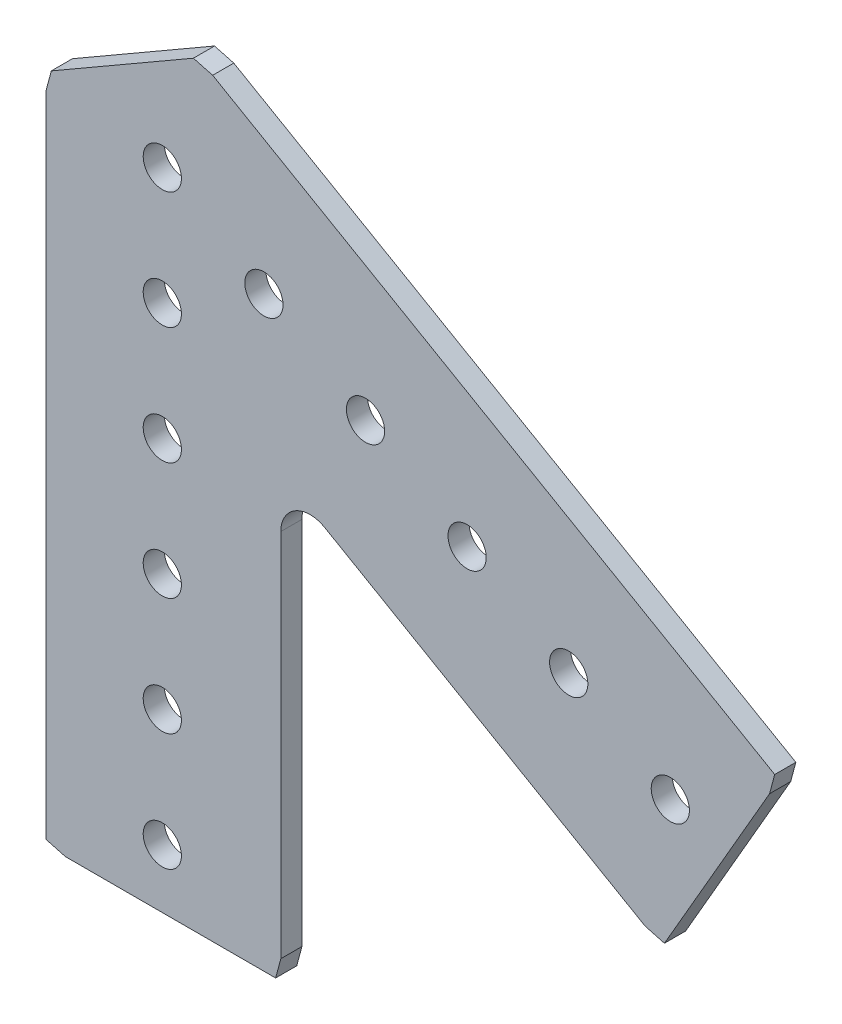
ISO-10303-21;
HEADER;
FILE_DESCRIPTION(('STEP AP214'),'2;1');
FILE_NAME('part.step','',(''),(''),'','','');
FILE_SCHEMA(('AUTOMOTIVE_DESIGN { 1 0 10303 214 1 1 1 1 }'));
ENDSEC;
DATA;
#1=APPLICATION_CONTEXT('core data for automotive mechanical design processes');
#2=APPLICATION_PROTOCOL_DEFINITION('international standard','automotive_design',2000,#1);
#3=PRODUCT_CONTEXT('',#1,'mechanical');
#4=PRODUCT('Part','Part','',(#3));
#5=PRODUCT_RELATED_PRODUCT_CATEGORY('part','',(#4));
#6=PRODUCT_DEFINITION_FORMATION('','',#4);
#7=PRODUCT_DEFINITION_CONTEXT('part definition',#1,'design');
#8=PRODUCT_DEFINITION('design','',#6,#7);
#9=PRODUCT_DEFINITION_SHAPE('','',#8);
#10=(LENGTH_UNIT() NAMED_UNIT(*) SI_UNIT(.MILLI.,.METRE.));
#11=(NAMED_UNIT(*) PLANE_ANGLE_UNIT() SI_UNIT($,.RADIAN.));
#12=(NAMED_UNIT(*) SI_UNIT($,.STERADIAN.) SOLID_ANGLE_UNIT());
#13=UNCERTAINTY_MEASURE_WITH_UNIT(LENGTH_MEASURE(1.E-05),#10,'distance_accuracy_value','');
#14=(GEOMETRIC_REPRESENTATION_CONTEXT(3) GLOBAL_UNCERTAINTY_ASSIGNED_CONTEXT((#13)) GLOBAL_UNIT_ASSIGNED_CONTEXT((#10,
#11,#12)) REPRESENTATION_CONTEXT('',''));
#15=CARTESIAN_POINT('',(0.,0.,0.));
#16=DIRECTION('',(0.,0.,1.));
#17=DIRECTION('',(1.,0.,0.));
#18=AXIS2_PLACEMENT_3D('',#15,#16,#17);
#19=CARTESIAN_POINT('',(66.7783744543429,-24.0364625982186,2.286));
#20=DIRECTION('',(0.,0.,1.));
#21=DIRECTION('',(1.,0.,0.));
#22=AXIS2_PLACEMENT_3D('',#19,#20,#21);
#23=PLANE('',#22);
#24=DIRECTION('',(0.866025403784439,-0.5,0.));
#25=VECTOR('',#24,1.);
#26=CARTESIAN_POINT('',(-6.41350000000018,-11.1085078543433,2.286));
#27=LINE('',#26,#25);
#28=CARTESIAN_POINT('',(52.2723357545729,-44.9907909248642,2.286));
#29=VERTEX_POINT('',#28);
#30=CARTESIAN_POINT('',(17.5895,-24.966646365702,2.286));
#31=VERTEX_POINT('',#30);
#32=EDGE_CURVE('E120',#29,#31,#27,.F.);
#33=ORIENTED_EDGE('',*,*,#32,.F.);
#34=DIRECTION('',(0.965925826289069,-0.258819045102517,0.));
#35=VECTOR('',#34,1.);
#36=CARTESIAN_POINT('',(-7.74611519323443,-28.9088954624325,2.286));
#37=LINE('',#36,#35);
#38=CARTESIAN_POINT('',(54.357769613531,-45.5495812432405,2.286));
#39=VERTEX_POINT('',#38);
#40=EDGE_CURVE('E138',#39,#29,#37,.F.);
#41=ORIENTED_EDGE('',*,*,#40,.F.);
#42=DIRECTION('',(-0.500000000000004,-0.866025403784436,0.));
#43=VECTOR('',#42,1.);
#44=CARTESIAN_POINT('',(66.7783744543429,-24.0364625982186,2.286));
#45=LINE('',#44,#43);
#46=CARTESIAN_POINT('',(65.7356575248637,-25.8425012979888,2.286));
#47=VERTEX_POINT('',#46);
#48=EDGE_CURVE('E258',#39,#47,#45,.F.);
#49=ORIENTED_EDGE('',*,*,#48,.T.);
#50=DIRECTION('',(0.258819045102515,0.96592582628907,0.));
#51=VECTOR('',#50,1.);
#52=CARTESIAN_POINT('',(67.7928287624319,-18.1650337195146,2.286));
#53=LINE('',#52,#51);
#54=CARTESIAN_POINT('',(66.2944478432401,-23.7570674390303,2.286));
#55=VERTEX_POINT('',#54);
#56=EDGE_CURVE('E256',#55,#47,#53,.F.);
#57=ORIENTED_EDGE('',*,*,#56,.F.);
#58=DIRECTION('',(0.866025403784436,-0.500000000000004,0.));
#59=VECTOR('',#58,1.);
#60=CARTESIAN_POINT('',(3.92478394209358,12.2520748035635,2.286));
#61=LINE('',#60,#59);
#62=CARTESIAN_POINT('',(5.45142748267629,11.3706667444515,2.286));
#63=VERTEX_POINT('',#62);
#64=EDGE_CURVE('E236',#55,#63,#61,.F.);
#65=ORIENTED_EDGE('',*,*,#64,.T.);
#66=DIRECTION('',(0.96592582628907,-0.258819045102515,0.));
#67=VECTOR('',#66,1.);
#68=CARTESIAN_POINT('',(3.20784308400778,11.9718333722257,2.286));
#69=LINE('',#68,#67);
#70=CARTESIAN_POINT('',(3.36599362371686,11.9294570628281,2.286));
#71=VERTEX_POINT('',#70);
#72=EDGE_CURVE('E225',#63,#71,#69,.F.);
#73=ORIENTED_EDGE('',*,*,#72,.T.);
#74=DIRECTION('',(0.86602540378444,0.499999999999998,0.));
#75=VECTOR('',#74,1.);
#76=CARTESIAN_POINT('',(-12.573,2.72707480356353,2.286));
#77=LINE('',#76,#75);
#78=CARTESIAN_POINT('',(-12.0142096816237,3.04969254429867,2.286));
#79=VERTEX_POINT('',#78);
#80=EDGE_CURVE('E224',#71,#79,#77,.F.);
#81=ORIENTED_EDGE('',*,*,#80,.T.);
#82=DIRECTION('',(-0.258819045102515,-0.96592582628907,0.));
#83=VECTOR('',#82,1.);
#84=CARTESIAN_POINT('',(-11.971833372226,3.20784308400785,2.286));
#85=LINE('',#84,#83);
#86=CARTESIAN_POINT('',(-12.573,0.964258685340516,2.286));
#87=VERTEX_POINT('',#86);
#88=EDGE_CURVE('E213',#87,#79,#85,.F.);
#89=ORIENTED_EDGE('',*,*,#88,.F.);
#90=DIRECTION('',(0.,1.,0.));
#91=VECTOR('',#90,1.);
#92=CARTESIAN_POINT('',(-12.573,-69.85,2.286));
#93=LINE('',#92,#91);
#94=CARTESIAN_POINT('',(-12.573,-69.2912096816237,2.286));
#95=VERTEX_POINT('',#94);
#96=EDGE_CURVE('E193',#87,#95,#93,.F.);
#97=ORIENTED_EDGE('',*,*,#96,.T.);
#98=DIRECTION('',(-0.965925826289072,0.258819045102508,0.));
#99=VECTOR('',#98,1.);
#100=CARTESIAN_POINT('',(-18.1650337195142,-67.7928287624323,2.286));
#101=LINE('',#100,#99);
#102=CARTESIAN_POINT('',(-10.4875661410418,-69.85,2.286));
#103=VERTEX_POINT('',#102);
#104=EDGE_CURVE('E182',#95,#103,#101,.F.);
#105=ORIENTED_EDGE('',*,*,#104,.T.);
#106=DIRECTION('',(-1.,0.,0.));
#107=VECTOR('',#106,1.);
#108=CARTESIAN_POINT('',(12.827,-69.85,2.286));
#109=LINE('',#108,#107);
#110=CARTESIAN_POINT('',(12.2682096816237,-69.85,2.286));
#111=VERTEX_POINT('',#110);
#112=EDGE_CURVE('E181',#103,#111,#109,.F.);
#113=ORIENTED_EDGE('',*,*,#112,.T.);
#114=DIRECTION('',(0.258819045102515,0.96592582628907,0.));
#115=VECTOR('',#114,1.);
#116=CARTESIAN_POINT('',(28.9088954624317,-7.74611519323413,2.286));
#117=LINE('',#116,#115);
#118=CARTESIAN_POINT('',(12.827,-67.7645661410419,2.286));
#119=VERTEX_POINT('',#118);
#120=EDGE_CURVE('E170',#119,#111,#117,.F.);
#121=ORIENTED_EDGE('',*,*,#120,.F.);
#122=DIRECTION('',(0.,-1.,0.));
#123=VECTOR('',#122,1.);
#124=CARTESIAN_POINT('',(12.827,0.,2.286));
#125=LINE('',#124,#123);
#126=CARTESIAN_POINT('',(12.827,-27.7162770227176,2.286));
#127=VERTEX_POINT('',#126);
#128=EDGE_CURVE('E114',#119,#127,#125,.F.);
#129=ORIENTED_EDGE('',*,*,#128,.T.);
#130=CARTESIAN_POINT('',(16.002,-27.7162770227176,2.286));
#131=DIRECTION('',(0.,0.,1.));
#132=DIRECTION('',(1.,0.,0.));
#133=AXIS2_PLACEMENT_3D('',#130,#131,#132);
#134=CIRCLE('',#133,3.175);
#135=EDGE_CURVE('E127',#127,#31,#134,.F.);
#136=ORIENTED_EDGE('',*,*,#135,.T.);
#137=EDGE_LOOP('',(#33,#41,#49,#57,#65,#73,#81,#89,#97,#105,#113,#121,#129,#136));
#138=FACE_BOUND('',#137,.T.);
#139=CARTESIAN_POINT('',(54.9926131403117,-31.7500000000003,2.286));
#140=DIRECTION('',(0.,0.,-1.));
#141=DIRECTION('',(-1.,0.,0.));
#142=AXIS2_PLACEMENT_3D('',#139,#140,#141);
#143=CIRCLE('',#142,2.0701);
#144=CARTESIAN_POINT('',(52.9225131403117,-31.7500000000003,2.286));
#145=VERTEX_POINT('',#144);
#146=EDGE_CURVE('E253',#145,#145,#143,.T.);
#147=ORIENTED_EDGE('',*,*,#146,.T.);
#148=EDGE_LOOP('',(#147));
#149=FACE_BOUND('',#148,.T.);
#150=CARTESIAN_POINT('',(32.9955678841874,-19.0499999999996,2.286));
#151=DIRECTION('',(0.,0.,-1.));
#152=DIRECTION('',(-1.,0.,0.));
#153=AXIS2_PLACEMENT_3D('',#150,#151,#152);
#154=CIRCLE('',#153,2.0701);
#155=CARTESIAN_POINT('',(30.9254678841874,-19.0499999999996,2.286));
#156=VERTEX_POINT('',#155);
#157=EDGE_CURVE('E340',#156,#156,#154,.T.);
#158=ORIENTED_EDGE('',*,*,#157,.T.);
#159=EDGE_LOOP('',(#158));
#160=FACE_BOUND('',#159,.T.);
#161=CARTESIAN_POINT('',(0.,-50.8,2.286));
#162=DIRECTION('',(0.,0.,-1.));
#163=DIRECTION('',(-1.,0.,0.));
#164=AXIS2_PLACEMENT_3D('',#161,#162,#163);
#165=CIRCLE('',#164,2.0701);
#166=CARTESIAN_POINT('',(-2.07009999999999,-50.8,2.286));
#167=VERTEX_POINT('',#166);
#168=EDGE_CURVE('E343',#167,#167,#165,.T.);
#169=ORIENTED_EDGE('',*,*,#168,.T.);
#170=EDGE_LOOP('',(#169));
#171=FACE_BOUND('',#170,.T.);
#172=CARTESIAN_POINT('',(2.66050878019847E-13,-25.4,2.286));
#173=DIRECTION('',(0.,0.,-1.));
#174=DIRECTION('',(-1.,0.,0.));
#175=AXIS2_PLACEMENT_3D('',#172,#173,#174);
#176=CIRCLE('',#175,2.0701);
#177=CARTESIAN_POINT('',(-2.07009999999973,-25.4,2.286));
#178=VERTEX_POINT('',#177);
#179=EDGE_CURVE('E346',#178,#178,#176,.T.);
#180=ORIENTED_EDGE('',*,*,#179,.T.);
#181=EDGE_LOOP('',(#180));
#182=FACE_BOUND('',#181,.T.);
#183=CARTESIAN_POINT('',(10.9985226280625,-6.34999999999986,2.286));
#184=DIRECTION('',(0.,0.,-1.));
#185=DIRECTION('',(-1.,0.,0.));
#186=AXIS2_PLACEMENT_3D('',#183,#184,#185);
#187=CIRCLE('',#186,2.0701);
#188=CARTESIAN_POINT('',(8.92842262806245,-6.34999999999986,2.286));
#189=VERTEX_POINT('',#188);
#190=EDGE_CURVE('E349',#189,#189,#187,.T.);
#191=ORIENTED_EDGE('',*,*,#190,.T.);
#192=EDGE_LOOP('',(#191));
#193=FACE_BOUND('',#192,.T.);
#194=CARTESIAN_POINT('',(0.,0.,2.286));
#195=DIRECTION('',(0.,0.,-1.));
#196=DIRECTION('',(-1.,0.,0.));
#197=AXIS2_PLACEMENT_3D('',#194,#195,#196);
#198=CIRCLE('',#197,2.0701);
#199=CARTESIAN_POINT('',(-2.0701,0.,2.286));
#200=VERTEX_POINT('',#199);
#201=EDGE_CURVE('E352',#200,#200,#198,.T.);
#202=ORIENTED_EDGE('',*,*,#201,.T.);
#203=EDGE_LOOP('',(#202));
#204=FACE_BOUND('',#203,.T.);
#205=CARTESIAN_POINT('',(1.33025439009923E-13,-12.7,2.286));
#206=DIRECTION('',(0.,0.,-1.));
#207=DIRECTION('',(-1.,0.,0.));
#208=AXIS2_PLACEMENT_3D('',#205,#206,#207);
#209=CIRCLE('',#208,2.0701);
#210=CARTESIAN_POINT('',(-2.07009999999987,-12.7,2.286));
#211=VERTEX_POINT('',#210);
#212=EDGE_CURVE('E355',#211,#211,#209,.T.);
#213=ORIENTED_EDGE('',*,*,#212,.T.);
#214=EDGE_LOOP('',(#213));
#215=FACE_BOUND('',#214,.T.);
#216=CARTESIAN_POINT('',(3.9907631702977E-13,-38.1,2.286));
#217=DIRECTION('',(0.,0.,-1.));
#218=DIRECTION('',(-1.,0.,0.));
#219=AXIS2_PLACEMENT_3D('',#216,#217,#218);
#220=CIRCLE('',#219,2.0701);
#221=CARTESIAN_POINT('',(-2.0700999999996,-38.1,2.286));
#222=VERTEX_POINT('',#221);
#223=EDGE_CURVE('E358',#222,#222,#220,.T.);
#224=ORIENTED_EDGE('',*,*,#223,.T.);
#225=EDGE_LOOP('',(#224));
#226=FACE_BOUND('',#225,.T.);
#227=CARTESIAN_POINT('',(21.9970452561249,-12.6999999999997,2.286));
#228=DIRECTION('',(0.,0.,-1.));
#229=DIRECTION('',(-1.,0.,0.));
#230=AXIS2_PLACEMENT_3D('',#227,#228,#229);
#231=CIRCLE('',#230,2.0701);
#232=CARTESIAN_POINT('',(19.9269452561249,-12.6999999999997,2.286));
#233=VERTEX_POINT('',#232);
#234=EDGE_CURVE('E361',#233,#233,#231,.T.);
#235=ORIENTED_EDGE('',*,*,#234,.T.);
#236=EDGE_LOOP('',(#235));
#237=FACE_BOUND('',#236,.T.);
#238=CARTESIAN_POINT('',(43.9940905122498,-25.3999999999994,2.286));
#239=DIRECTION('',(0.,0.,-1.));
#240=DIRECTION('',(-1.,0.,0.));
#241=AXIS2_PLACEMENT_3D('',#238,#239,#240);
#242=CIRCLE('',#241,2.0701);
#243=CARTESIAN_POINT('',(41.9239905122498,-25.3999999999994,2.286));
#244=VERTEX_POINT('',#243);
#245=EDGE_CURVE('E363',#244,#244,#242,.T.);
#246=ORIENTED_EDGE('',*,*,#245,.T.);
#247=EDGE_LOOP('',(#246));
#248=FACE_BOUND('',#247,.T.);
#249=CARTESIAN_POINT('',(0.,-63.5,2.286));
#250=DIRECTION('',(0.,0.,-1.));
#251=DIRECTION('',(-1.,0.,0.));
#252=AXIS2_PLACEMENT_3D('',#249,#250,#251);
#253=CIRCLE('',#252,2.0701);
#254=CARTESIAN_POINT('',(-2.07009999999999,-63.5,2.286));
#255=VERTEX_POINT('',#254);
#256=EDGE_CURVE('E20',#255,#255,#253,.T.);
#257=ORIENTED_EDGE('',*,*,#256,.T.);
#258=EDGE_LOOP('',(#257));
#259=FACE_BOUND('',#258,.T.);
#260=ADVANCED_FACE('F17',(#138,#149,#160,#171,#182,#193,#204,#215,#226,#237,#248,#259),#23,.T.);
#261=CARTESIAN_POINT('',(0.,-63.5,2.286));
#262=DIRECTION('',(0.,0.,-1.));
#263=DIRECTION('',(-1.,0.,0.));
#264=AXIS2_PLACEMENT_3D('',#261,#262,#263);
#265=CYLINDRICAL_SURFACE('',#264,2.0701);
#266=CARTESIAN_POINT('',(0.,-63.5,0.));
#267=DIRECTION('',(0.,0.,-1.));
#268=DIRECTION('',(-1.,0.,0.));
#269=AXIS2_PLACEMENT_3D('',#266,#267,#268);
#270=CIRCLE('',#269,2.0701);
#271=CARTESIAN_POINT('',(-2.07009999999999,-63.5,0.));
#272=VERTEX_POINT('',#271);
#273=EDGE_CURVE('E247',#272,#272,#270,.T.);
#274=ORIENTED_EDGE('',*,*,#273,.T.);
#275=EDGE_LOOP('',(#274));
#276=FACE_BOUND('',#275,.T.);
#277=ORIENTED_EDGE('',*,*,#256,.F.);
#278=EDGE_LOOP('',(#277));
#279=FACE_BOUND('',#278,.T.);
#280=ADVANCED_FACE('F371',(#276,#279),#265,.F.);
#281=CARTESIAN_POINT('',(43.9940905122498,-25.3999999999994,2.286));
#282=DIRECTION('',(0.,0.,-1.));
#283=DIRECTION('',(-1.,0.,0.));
#284=AXIS2_PLACEMENT_3D('',#281,#282,#283);
#285=CYLINDRICAL_SURFACE('',#284,2.0701);
#286=CARTESIAN_POINT('',(43.9940905122498,-25.3999999999994,0.));
#287=DIRECTION('',(0.,0.,-1.));
#288=DIRECTION('',(-1.,0.,0.));
#289=AXIS2_PLACEMENT_3D('',#286,#287,#288);
#290=CIRCLE('',#289,2.0701);
#291=CARTESIAN_POINT('',(41.9239905122498,-25.3999999999994,0.));
#292=VERTEX_POINT('',#291);
#293=EDGE_CURVE('E333',#292,#292,#290,.T.);
#294=ORIENTED_EDGE('',*,*,#293,.T.);
#295=EDGE_LOOP('',(#294));
#296=FACE_BOUND('',#295,.T.);
#297=ORIENTED_EDGE('',*,*,#245,.F.);
#298=EDGE_LOOP('',(#297));
#299=FACE_BOUND('',#298,.T.);
#300=ADVANCED_FACE('F373',(#296,#299),#285,.F.);
#301=CARTESIAN_POINT('',(21.9970452561249,-12.6999999999997,2.286));
#302=DIRECTION('',(0.,0.,-1.));
#303=DIRECTION('',(-1.,0.,0.));
#304=AXIS2_PLACEMENT_3D('',#301,#302,#303);
#305=CYLINDRICAL_SURFACE('',#304,2.0701);
#306=CARTESIAN_POINT('',(21.9970452561249,-12.6999999999997,0.));
#307=DIRECTION('',(0.,0.,-1.));
#308=DIRECTION('',(-1.,0.,0.));
#309=AXIS2_PLACEMENT_3D('',#306,#307,#308);
#310=CIRCLE('',#309,2.0701);
#311=CARTESIAN_POINT('',(19.9269452561249,-12.6999999999997,0.));
#312=VERTEX_POINT('',#311);
#313=EDGE_CURVE('E330',#312,#312,#310,.T.);
#314=ORIENTED_EDGE('',*,*,#313,.T.);
#315=EDGE_LOOP('',(#314));
#316=FACE_BOUND('',#315,.T.);
#317=ORIENTED_EDGE('',*,*,#234,.F.);
#318=EDGE_LOOP('',(#317));
#319=FACE_BOUND('',#318,.T.);
#320=ADVANCED_FACE('F380',(#316,#319),#305,.F.);
#321=CARTESIAN_POINT('',(3.9907631702977E-13,-38.1,2.286));
#322=DIRECTION('',(0.,0.,-1.));
#323=DIRECTION('',(-1.,0.,0.));
#324=AXIS2_PLACEMENT_3D('',#321,#322,#323);
#325=CYLINDRICAL_SURFACE('',#324,2.0701);
#326=CARTESIAN_POINT('',(3.9907631702977E-13,-38.1,0.));
#327=DIRECTION('',(0.,0.,-1.));
#328=DIRECTION('',(-1.,0.,0.));
#329=AXIS2_PLACEMENT_3D('',#326,#327,#328);
#330=CIRCLE('',#329,2.0701);
#331=CARTESIAN_POINT('',(-2.0700999999996,-38.1,0.));
#332=VERTEX_POINT('',#331);
#333=EDGE_CURVE('E327',#332,#332,#330,.T.);
#334=ORIENTED_EDGE('',*,*,#333,.T.);
#335=EDGE_LOOP('',(#334));
#336=FACE_BOUND('',#335,.T.);
#337=ORIENTED_EDGE('',*,*,#223,.F.);
#338=EDGE_LOOP('',(#337));
#339=FACE_BOUND('',#338,.T.);
#340=ADVANCED_FACE('F470',(#336,#339),#325,.F.);
#341=CARTESIAN_POINT('',(1.33025439009923E-13,-12.7,2.286));
#342=DIRECTION('',(0.,0.,-1.));
#343=DIRECTION('',(-1.,0.,0.));
#344=AXIS2_PLACEMENT_3D('',#341,#342,#343);
#345=CYLINDRICAL_SURFACE('',#344,2.0701);
#346=CARTESIAN_POINT('',(1.33025439009923E-13,-12.7,0.));
#347=DIRECTION('',(0.,0.,-1.));
#348=DIRECTION('',(-1.,0.,0.));
#349=AXIS2_PLACEMENT_3D('',#346,#347,#348);
#350=CIRCLE('',#349,2.0701);
#351=CARTESIAN_POINT('',(-2.07009999999987,-12.7,0.));
#352=VERTEX_POINT('',#351);
#353=EDGE_CURVE('E324',#352,#352,#350,.T.);
#354=ORIENTED_EDGE('',*,*,#353,.T.);
#355=EDGE_LOOP('',(#354));
#356=FACE_BOUND('',#355,.T.);
#357=ORIENTED_EDGE('',*,*,#212,.F.);
#358=EDGE_LOOP('',(#357));
#359=FACE_BOUND('',#358,.T.);
#360=ADVANCED_FACE('F466',(#356,#359),#345,.F.);
#361=CARTESIAN_POINT('',(0.,0.,2.286));
#362=DIRECTION('',(0.,0.,-1.));
#363=DIRECTION('',(-1.,0.,0.));
#364=AXIS2_PLACEMENT_3D('',#361,#362,#363);
#365=CYLINDRICAL_SURFACE('',#364,2.0701);
#366=CARTESIAN_POINT('',(0.,0.,0.));
#367=DIRECTION('',(0.,0.,-1.));
#368=DIRECTION('',(-1.,0.,0.));
#369=AXIS2_PLACEMENT_3D('',#366,#367,#368);
#370=CIRCLE('',#369,2.0701);
#371=CARTESIAN_POINT('',(-2.0701,0.,0.));
#372=VERTEX_POINT('',#371);
#373=EDGE_CURVE('E321',#372,#372,#370,.T.);
#374=ORIENTED_EDGE('',*,*,#373,.T.);
#375=EDGE_LOOP('',(#374));
#376=FACE_BOUND('',#375,.T.);
#377=ORIENTED_EDGE('',*,*,#201,.F.);
#378=EDGE_LOOP('',(#377));
#379=FACE_BOUND('',#378,.T.);
#380=ADVANCED_FACE('F462',(#376,#379),#365,.F.);
#381=CARTESIAN_POINT('',(10.9985226280625,-6.34999999999986,2.286));
#382=DIRECTION('',(0.,0.,-1.));
#383=DIRECTION('',(-1.,0.,0.));
#384=AXIS2_PLACEMENT_3D('',#381,#382,#383);
#385=CYLINDRICAL_SURFACE('',#384,2.0701);
#386=CARTESIAN_POINT('',(10.9985226280625,-6.34999999999986,0.));
#387=DIRECTION('',(0.,0.,-1.));
#388=DIRECTION('',(-1.,0.,0.));
#389=AXIS2_PLACEMENT_3D('',#386,#387,#388);
#390=CIRCLE('',#389,2.0701);
#391=CARTESIAN_POINT('',(8.92842262806245,-6.34999999999986,0.));
#392=VERTEX_POINT('',#391);
#393=EDGE_CURVE('E318',#392,#392,#390,.T.);
#394=ORIENTED_EDGE('',*,*,#393,.T.);
#395=EDGE_LOOP('',(#394));
#396=FACE_BOUND('',#395,.T.);
#397=ORIENTED_EDGE('',*,*,#190,.F.);
#398=EDGE_LOOP('',(#397));
#399=FACE_BOUND('',#398,.T.);
#400=ADVANCED_FACE('F458',(#396,#399),#385,.F.);
#401=CARTESIAN_POINT('',(2.66050878019847E-13,-25.4,2.286));
#402=DIRECTION('',(0.,0.,-1.));
#403=DIRECTION('',(-1.,0.,0.));
#404=AXIS2_PLACEMENT_3D('',#401,#402,#403);
#405=CYLINDRICAL_SURFACE('',#404,2.0701);
#406=CARTESIAN_POINT('',(2.66050878019847E-13,-25.4,0.));
#407=DIRECTION('',(0.,0.,-1.));
#408=DIRECTION('',(-1.,0.,0.));
#409=AXIS2_PLACEMENT_3D('',#406,#407,#408);
#410=CIRCLE('',#409,2.0701);
#411=CARTESIAN_POINT('',(-2.07009999999973,-25.4,0.));
#412=VERTEX_POINT('',#411);
#413=EDGE_CURVE('E315',#412,#412,#410,.T.);
#414=ORIENTED_EDGE('',*,*,#413,.T.);
#415=EDGE_LOOP('',(#414));
#416=FACE_BOUND('',#415,.T.);
#417=ORIENTED_EDGE('',*,*,#179,.F.);
#418=EDGE_LOOP('',(#417));
#419=FACE_BOUND('',#418,.T.);
#420=ADVANCED_FACE('F454',(#416,#419),#405,.F.);
#421=CARTESIAN_POINT('',(0.,-50.8,2.286));
#422=DIRECTION('',(0.,0.,-1.));
#423=DIRECTION('',(-1.,0.,0.));
#424=AXIS2_PLACEMENT_3D('',#421,#422,#423);
#425=CYLINDRICAL_SURFACE('',#424,2.0701);
#426=CARTESIAN_POINT('',(0.,-50.8,0.));
#427=DIRECTION('',(0.,0.,-1.));
#428=DIRECTION('',(-1.,0.,0.));
#429=AXIS2_PLACEMENT_3D('',#426,#427,#428);
#430=CIRCLE('',#429,2.0701);
#431=CARTESIAN_POINT('',(-2.07009999999999,-50.8,0.));
#432=VERTEX_POINT('',#431);
#433=EDGE_CURVE('E312',#432,#432,#430,.T.);
#434=ORIENTED_EDGE('',*,*,#433,.T.);
#435=EDGE_LOOP('',(#434));
#436=FACE_BOUND('',#435,.T.);
#437=ORIENTED_EDGE('',*,*,#168,.F.);
#438=EDGE_LOOP('',(#437));
#439=FACE_BOUND('',#438,.T.);
#440=ADVANCED_FACE('F450',(#436,#439),#425,.F.);
#441=CARTESIAN_POINT('',(32.9955678841874,-19.0499999999996,2.286));
#442=DIRECTION('',(0.,0.,-1.));
#443=DIRECTION('',(-1.,0.,0.));
#444=AXIS2_PLACEMENT_3D('',#441,#442,#443);
#445=CYLINDRICAL_SURFACE('',#444,2.0701);
#446=CARTESIAN_POINT('',(32.9955678841874,-19.0499999999996,0.));
#447=DIRECTION('',(0.,0.,-1.));
#448=DIRECTION('',(-1.,0.,0.));
#449=AXIS2_PLACEMENT_3D('',#446,#447,#448);
#450=CIRCLE('',#449,2.0701);
#451=CARTESIAN_POINT('',(30.9254678841874,-19.0499999999996,0.));
#452=VERTEX_POINT('',#451);
#453=EDGE_CURVE('E309',#452,#452,#450,.T.);
#454=ORIENTED_EDGE('',*,*,#453,.T.);
#455=EDGE_LOOP('',(#454));
#456=FACE_BOUND('',#455,.T.);
#457=ORIENTED_EDGE('',*,*,#157,.F.);
#458=EDGE_LOOP('',(#457));
#459=FACE_BOUND('',#458,.T.);
#460=ADVANCED_FACE('F446',(#456,#459),#445,.F.);
#461=CARTESIAN_POINT('',(54.9926131403117,-31.7500000000003,2.286));
#462=DIRECTION('',(0.,0.,-1.));
#463=DIRECTION('',(-1.,0.,0.));
#464=AXIS2_PLACEMENT_3D('',#461,#462,#463);
#465=CYLINDRICAL_SURFACE('',#464,2.0701);
#466=CARTESIAN_POINT('',(54.9926131403117,-31.7500000000003,0.));
#467=DIRECTION('',(0.,0.,-1.));
#468=DIRECTION('',(-1.,0.,0.));
#469=AXIS2_PLACEMENT_3D('',#466,#467,#468);
#470=CIRCLE('',#469,2.0701);
#471=CARTESIAN_POINT('',(52.9225131403117,-31.7500000000003,0.));
#472=VERTEX_POINT('',#471);
#473=EDGE_CURVE('E241',#472,#472,#470,.T.);
#474=ORIENTED_EDGE('',*,*,#473,.T.);
#475=EDGE_LOOP('',(#474));
#476=FACE_BOUND('',#475,.T.);
#477=ORIENTED_EDGE('',*,*,#146,.F.);
#478=EDGE_LOOP('',(#477));
#479=FACE_BOUND('',#478,.T.);
#480=ADVANCED_FACE('F442',(#476,#479),#465,.F.);
#481=CARTESIAN_POINT('',(3.92478394209358,12.2520748035635,2.286));
#482=DIRECTION('',(-0.500000000000004,-0.866025403784436,0.));
#483=DIRECTION('',(0.866025403784436,-0.500000000000004,0.));
#484=AXIS2_PLACEMENT_3D('',#481,#482,#483);
#485=PLANE('',#484);
#486=DIRECTION('',(-0.866025403784436,0.500000000000004,0.));
#487=VECTOR('',#486,1.);
#488=CARTESIAN_POINT('',(66.2944478432401,-23.7570674390303,0.));
#489=LINE('',#488,#487);
#490=CARTESIAN_POINT('',(66.2944478432401,-23.7570674390303,0.));
#491=VERTEX_POINT('',#490);
#492=CARTESIAN_POINT('',(5.45142748267643,11.3706667444514,0.));
#493=VERTEX_POINT('',#492);
#494=EDGE_CURVE('E230',#491,#493,#489,.T.);
#495=ORIENTED_EDGE('',*,*,#494,.T.);
#496=DIRECTION('',(0.,0.,1.));
#497=VECTOR('',#496,1.);
#498=CARTESIAN_POINT('',(5.45142748267629,11.3706667444515,0.));
#499=LINE('',#498,#497);
#500=EDGE_CURVE('E233',#493,#63,#499,.T.);
#501=ORIENTED_EDGE('',*,*,#500,.T.);
#502=ORIENTED_EDGE('',*,*,#64,.F.);
#503=DIRECTION('',(0.,0.,1.));
#504=VECTOR('',#503,1.);
#505=CARTESIAN_POINT('',(66.2944478432401,-23.7570674390303,0.));
#506=LINE('',#505,#504);
#507=EDGE_CURVE('E244',#491,#55,#506,.T.);
#508=ORIENTED_EDGE('',*,*,#507,.F.);
#509=EDGE_LOOP('',(#495,#501,#502,#508));
#510=FACE_BOUND('',#509,.T.);
#511=ADVANCED_FACE('F438',(#510),#485,.F.);
#512=CARTESIAN_POINT('',(3.20784308400778,11.9718333722257,0.));
#513=DIRECTION('',(-0.258819045102515,-0.96592582628907,0.));
#514=DIRECTION('',(0.96592582628907,-0.258819045102515,0.));
#515=AXIS2_PLACEMENT_3D('',#512,#513,#514);
#516=PLANE('',#515);
#517=ORIENTED_EDGE('',*,*,#500,.F.);
#518=DIRECTION('',(-0.96592582628907,0.258819045102515,0.));
#519=VECTOR('',#518,1.);
#520=CARTESIAN_POINT('',(5.45142748267629,11.3706667444515,0.));
#521=LINE('',#520,#519);
#522=CARTESIAN_POINT('',(3.36599362371687,11.9294570628281,0.));
#523=VERTEX_POINT('',#522);
#524=EDGE_CURVE('E218',#493,#523,#521,.T.);
#525=ORIENTED_EDGE('',*,*,#524,.T.);
#526=DIRECTION('',(0.,0.,1.));
#527=VECTOR('',#526,1.);
#528=CARTESIAN_POINT('',(3.36599362371686,11.9294570628281,2.286));
#529=LINE('',#528,#527);
#530=EDGE_CURVE('E221',#523,#71,#529,.T.);
#531=ORIENTED_EDGE('',*,*,#530,.T.);
#532=ORIENTED_EDGE('',*,*,#72,.F.);
#533=EDGE_LOOP('',(#517,#525,#531,#532));
#534=FACE_BOUND('',#533,.T.);
#535=ADVANCED_FACE('F434',(#534),#516,.F.);
#536=CARTESIAN_POINT('',(-12.573,2.72707480356353,2.286));
#537=DIRECTION('',(0.499999999999998,-0.86602540378444,0.));
#538=DIRECTION('',(0.86602540378444,0.499999999999998,0.));
#539=AXIS2_PLACEMENT_3D('',#536,#537,#538);
#540=PLANE('',#539);
#541=ORIENTED_EDGE('',*,*,#80,.F.);
#542=ORIENTED_EDGE('',*,*,#530,.F.);
#543=DIRECTION('',(-0.86602540378444,-0.499999999999998,0.));
#544=VECTOR('',#543,1.);
#545=CARTESIAN_POINT('',(3.36599362371687,11.9294570628281,0.));
#546=LINE('',#545,#544);
#547=CARTESIAN_POINT('',(-12.0142096816237,3.04969254429866,0.));
#548=VERTEX_POINT('',#547);
#549=EDGE_CURVE('E209',#523,#548,#546,.T.);
#550=ORIENTED_EDGE('',*,*,#549,.T.);
#551=DIRECTION('',(0.,0.,1.));
#552=VECTOR('',#551,1.);
#553=CARTESIAN_POINT('',(-12.0142096816237,3.04969254429867,0.));
#554=LINE('',#553,#552);
#555=EDGE_CURVE('E204',#79,#548,#554,.F.);
#556=ORIENTED_EDGE('',*,*,#555,.F.);
#557=EDGE_LOOP('',(#541,#542,#550,#556));
#558=FACE_BOUND('',#557,.T.);
#559=ADVANCED_FACE('F430',(#558),#540,.F.);
#560=CARTESIAN_POINT('',(-11.971833372226,3.20784308400785,0.));
#561=DIRECTION('',(-0.96592582628907,0.258819045102515,0.));
#562=DIRECTION('',(-0.258819045102515,-0.96592582628907,0.));
#563=AXIS2_PLACEMENT_3D('',#560,#561,#562);
#564=PLANE('',#563);
#565=DIRECTION('',(-0.258819045102515,-0.96592582628907,0.));
#566=VECTOR('',#565,1.);
#567=CARTESIAN_POINT('',(-12.0142096816237,3.04969254429866,0.));
#568=LINE('',#567,#566);
#569=CARTESIAN_POINT('',(-12.573,0.964258685340512,0.));
#570=VERTEX_POINT('',#569);
#571=EDGE_CURVE('E198',#548,#570,#568,.T.);
#572=ORIENTED_EDGE('',*,*,#571,.T.);
#573=DIRECTION('',(0.,0.,1.));
#574=VECTOR('',#573,1.);
#575=CARTESIAN_POINT('',(-12.573,0.964258685340516,2.286));
#576=LINE('',#575,#574);
#577=EDGE_CURVE('E201',#570,#87,#576,.T.);
#578=ORIENTED_EDGE('',*,*,#577,.T.);
#579=ORIENTED_EDGE('',*,*,#88,.T.);
#580=ORIENTED_EDGE('',*,*,#555,.T.);
#581=EDGE_LOOP('',(#572,#578,#579,#580));
#582=FACE_BOUND('',#581,.T.);
#583=ADVANCED_FACE('F426',(#582),#564,.T.);
#584=CARTESIAN_POINT('',(-12.573,-69.85,2.286));
#585=DIRECTION('',(1.,0.,0.));
#586=DIRECTION('',(0.,1.,0.));
#587=AXIS2_PLACEMENT_3D('',#584,#585,#586);
#588=PLANE('',#587);
#589=DIRECTION('',(0.,0.,1.));
#590=VECTOR('',#589,1.);
#591=CARTESIAN_POINT('',(-12.573,-69.2912096816237,0.));
#592=LINE('',#591,#590);
#593=CARTESIAN_POINT('',(-12.573,-69.2912096816237,0.));
#594=VERTEX_POINT('',#593);
#595=EDGE_CURVE('E190',#594,#95,#592,.T.);
#596=ORIENTED_EDGE('',*,*,#595,.T.);
#597=ORIENTED_EDGE('',*,*,#96,.F.);
#598=ORIENTED_EDGE('',*,*,#577,.F.);
#599=DIRECTION('',(0.,1.,0.));
#600=VECTOR('',#599,1.);
#601=CARTESIAN_POINT('',(-12.573,-24.0364625982186,0.));
#602=LINE('',#601,#600);
#603=EDGE_CURVE('E187',#570,#594,#602,.F.);
#604=ORIENTED_EDGE('',*,*,#603,.T.);
#605=EDGE_LOOP('',(#596,#597,#598,#604));
#606=FACE_BOUND('',#605,.T.);
#607=ADVANCED_FACE('F422',(#606),#588,.F.);
#608=CARTESIAN_POINT('',(-18.1650337195142,-67.7928287624323,0.));
#609=DIRECTION('',(0.258819045102508,0.965925826289072,0.));
#610=DIRECTION('',(-0.965925826289072,0.258819045102508,0.));
#611=AXIS2_PLACEMENT_3D('',#608,#609,#610);
#612=PLANE('',#611);
#613=ORIENTED_EDGE('',*,*,#595,.F.);
#614=DIRECTION('',(0.965925826289072,-0.258819045102507,0.));
#615=VECTOR('',#614,1.);
#616=CARTESIAN_POINT('',(-12.573,-69.2912096816237,0.));
#617=LINE('',#616,#615);
#618=CARTESIAN_POINT('',(-10.4875661410419,-69.85,0.));
#619=VERTEX_POINT('',#618);
#620=EDGE_CURVE('E175',#594,#619,#617,.T.);
#621=ORIENTED_EDGE('',*,*,#620,.T.);
#622=DIRECTION('',(0.,0.,1.));
#623=VECTOR('',#622,1.);
#624=CARTESIAN_POINT('',(-10.4875661410418,-69.85,2.286));
#625=LINE('',#624,#623);
#626=EDGE_CURVE('E178',#619,#103,#625,.T.);
#627=ORIENTED_EDGE('',*,*,#626,.T.);
#628=ORIENTED_EDGE('',*,*,#104,.F.);
#629=EDGE_LOOP('',(#613,#621,#627,#628));
#630=FACE_BOUND('',#629,.T.);
#631=ADVANCED_FACE('F418',(#630),#612,.F.);
#632=CARTESIAN_POINT('',(12.827,-69.85,2.286));
#633=DIRECTION('',(0.,1.,0.));
#634=DIRECTION('',(-1.,0.,0.));
#635=AXIS2_PLACEMENT_3D('',#632,#633,#634);
#636=PLANE('',#635);
#637=ORIENTED_EDGE('',*,*,#626,.F.);
#638=DIRECTION('',(1.,0.,0.));
#639=VECTOR('',#638,1.);
#640=CARTESIAN_POINT('',(66.7783744543429,-69.85,0.));
#641=LINE('',#640,#639);
#642=CARTESIAN_POINT('',(12.2682096816237,-69.85,0.));
#643=VERTEX_POINT('',#642);
#644=EDGE_CURVE('E165',#619,#643,#641,.T.);
#645=ORIENTED_EDGE('',*,*,#644,.T.);
#646=DIRECTION('',(0.,0.,1.));
#647=VECTOR('',#646,1.);
#648=CARTESIAN_POINT('',(12.2682096816237,-69.85,0.));
#649=LINE('',#648,#647);
#650=EDGE_CURVE('E168',#111,#643,#649,.F.);
#651=ORIENTED_EDGE('',*,*,#650,.F.);
#652=ORIENTED_EDGE('',*,*,#112,.F.);
#653=EDGE_LOOP('',(#637,#645,#651,#652));
#654=FACE_BOUND('',#653,.T.);
#655=ADVANCED_FACE('F414',(#654),#636,.F.);
#656=CARTESIAN_POINT('',(28.9088954624317,-7.74611519323413,0.));
#657=DIRECTION('',(0.96592582628907,-0.258819045102515,0.));
#658=DIRECTION('',(0.258819045102515,0.96592582628907,0.));
#659=AXIS2_PLACEMENT_3D('',#656,#657,#658);
#660=PLANE('',#659);
#661=DIRECTION('',(0.258819045102518,0.965925826289069,0.));
#662=VECTOR('',#661,1.);
#663=CARTESIAN_POINT('',(12.2682096816237,-69.85,0.));
#664=LINE('',#663,#662);
#665=CARTESIAN_POINT('',(12.827,-67.7645661410419,0.));
#666=VERTEX_POINT('',#665);
#667=EDGE_CURVE('E161',#643,#666,#664,.T.);
#668=ORIENTED_EDGE('',*,*,#667,.T.);
#669=DIRECTION('',(0.,0.,1.));
#670=VECTOR('',#669,1.);
#671=CARTESIAN_POINT('',(12.827,-67.7645661410419,0.));
#672=LINE('',#671,#670);
#673=EDGE_CURVE('E156',#666,#119,#672,.T.);
#674=ORIENTED_EDGE('',*,*,#673,.T.);
#675=ORIENTED_EDGE('',*,*,#120,.T.);
#676=ORIENTED_EDGE('',*,*,#650,.T.);
#677=EDGE_LOOP('',(#668,#674,#675,#676));
#678=FACE_BOUND('',#677,.T.);
#679=ADVANCED_FACE('F410',(#678),#660,.T.);
#680=CARTESIAN_POINT('',(12.827,0.,0.));
#681=DIRECTION('',(-1.,0.,0.));
#682=DIRECTION('',(0.,-1.,0.));
#683=AXIS2_PLACEMENT_3D('',#680,#681,#682);
#684=PLANE('',#683);
#685=DIRECTION('',(0.,1.,0.));
#686=VECTOR('',#685,1.);
#687=CARTESIAN_POINT('',(12.827,-24.0364625982186,0.));
#688=LINE('',#687,#686);
#689=CARTESIAN_POINT('',(12.827,-27.7162770227176,0.));
#690=VERTEX_POINT('',#689);
#691=EDGE_CURVE('E164',#666,#690,#688,.T.);
#692=ORIENTED_EDGE('',*,*,#691,.T.);
#693=DIRECTION('',(0.,0.,1.));
#694=VECTOR('',#693,1.);
#695=CARTESIAN_POINT('',(12.827,-27.7162770227176,0.));
#696=LINE('',#695,#694);
#697=EDGE_CURVE('E132',#690,#127,#696,.T.);
#698=ORIENTED_EDGE('',*,*,#697,.T.);
#699=ORIENTED_EDGE('',*,*,#128,.F.);
#700=ORIENTED_EDGE('',*,*,#673,.F.);
#701=EDGE_LOOP('',(#692,#698,#699,#700));
#702=FACE_BOUND('',#701,.T.);
#703=ADVANCED_FACE('F407',(#702),#684,.F.);
#704=CARTESIAN_POINT('',(16.002,-27.7162770227176,0.));
#705=DIRECTION('',(0.,0.,1.));
#706=DIRECTION('',(1.,0.,0.));
#707=AXIS2_PLACEMENT_3D('',#704,#705,#706);
#708=CYLINDRICAL_SURFACE('',#707,3.175);
#709=ORIENTED_EDGE('',*,*,#697,.F.);
#710=CARTESIAN_POINT('',(16.002,-27.7162770227176,0.));
#711=DIRECTION('',(0.,0.,1.));
#712=DIRECTION('',(1.,0.,0.));
#713=AXIS2_PLACEMENT_3D('',#710,#711,#712);
#714=CIRCLE('',#713,3.175);
#715=CARTESIAN_POINT('',(17.5895,-24.966646365702,0.));
#716=VERTEX_POINT('',#715);
#717=EDGE_CURVE('E137',#690,#716,#714,.F.);
#718=ORIENTED_EDGE('',*,*,#717,.T.);
#719=DIRECTION('',(0.,0.,1.));
#720=VECTOR('',#719,1.);
#721=CARTESIAN_POINT('',(17.5895,-24.966646365702,0.));
#722=LINE('',#721,#720);
#723=EDGE_CURVE('E124',#31,#716,#722,.F.);
#724=ORIENTED_EDGE('',*,*,#723,.F.);
#725=ORIENTED_EDGE('',*,*,#135,.F.);
#726=EDGE_LOOP('',(#709,#718,#724,#725));
#727=FACE_BOUND('',#726,.T.);
#728=ADVANCED_FACE('F135',(#727),#708,.F.);
#729=CARTESIAN_POINT('',(-6.41350000000018,-11.1085078543433,0.));
#730=DIRECTION('',(-0.5,-0.866025403784439,0.));
#731=DIRECTION('',(0.866025403784439,-0.5,0.));
#732=AXIS2_PLACEMENT_3D('',#729,#730,#731);
#733=PLANE('',#732);
#734=ORIENTED_EDGE('',*,*,#32,.T.);
#735=ORIENTED_EDGE('',*,*,#723,.T.);
#736=DIRECTION('',(0.866025403784439,-0.5,0.));
#737=VECTOR('',#736,1.);
#738=CARTESIAN_POINT('',(17.5895,-24.966646365702,0.));
#739=LINE('',#738,#737);
#740=CARTESIAN_POINT('',(52.2723357545729,-44.9907909248642,0.));
#741=VERTEX_POINT('',#740);
#742=EDGE_CURVE('E148',#716,#741,#739,.T.);
#743=ORIENTED_EDGE('',*,*,#742,.T.);
#744=DIRECTION('',(0.,0.,1.));
#745=VECTOR('',#744,1.);
#746=CARTESIAN_POINT('',(52.2723357545729,-44.9907909248642,0.));
#747=LINE('',#746,#745);
#748=EDGE_CURVE('E126',#29,#741,#747,.F.);
#749=ORIENTED_EDGE('',*,*,#748,.F.);
#750=EDGE_LOOP('',(#734,#735,#743,#749));
#751=FACE_BOUND('',#750,.T.);
#752=ADVANCED_FACE('F121',(#751),#733,.T.);
#753=CARTESIAN_POINT('',(-7.74611519323443,-28.9088954624325,0.));
#754=DIRECTION('',(-0.258819045102517,-0.965925826289069,0.));
#755=DIRECTION('',(0.965925826289069,-0.258819045102517,0.));
#756=AXIS2_PLACEMENT_3D('',#753,#754,#755);
#757=PLANE('',#756);
#758=DIRECTION('',(0.965925826289069,-0.258819045102518,0.));
#759=VECTOR('',#758,1.);
#760=CARTESIAN_POINT('',(52.2723357545729,-44.9907909248642,0.));
#761=LINE('',#760,#759);
#762=CARTESIAN_POINT('',(54.357769613531,-45.5495812432405,0.));
#763=VERTEX_POINT('',#762);
#764=EDGE_CURVE('E145',#741,#763,#761,.T.);
#765=ORIENTED_EDGE('',*,*,#764,.T.);
#766=DIRECTION('',(0.,0.,1.));
#767=VECTOR('',#766,1.);
#768=CARTESIAN_POINT('',(54.357769613531,-45.5495812432405,2.286));
#769=LINE('',#768,#767);
#770=EDGE_CURVE('E152',#763,#39,#769,.T.);
#771=ORIENTED_EDGE('',*,*,#770,.T.);
#772=ORIENTED_EDGE('',*,*,#40,.T.);
#773=ORIENTED_EDGE('',*,*,#748,.T.);
#774=EDGE_LOOP('',(#765,#771,#772,#773));
#775=FACE_BOUND('',#774,.T.);
#776=ADVANCED_FACE('F398',(#775),#757,.T.);
#777=CARTESIAN_POINT('',(66.7783744543429,-24.0364625982186,2.286));
#778=DIRECTION('',(-0.866025403784436,0.500000000000004,0.));
#779=DIRECTION('',(-0.500000000000004,-0.866025403784436,0.));
#780=AXIS2_PLACEMENT_3D('',#777,#778,#779);
#781=PLANE('',#780);
#782=ORIENTED_EDGE('',*,*,#48,.F.);
#783=ORIENTED_EDGE('',*,*,#770,.F.);
#784=DIRECTION('',(0.500000000000005,0.866025403784436,0.));
#785=VECTOR('',#784,1.);
#786=CARTESIAN_POINT('',(54.357769613531,-45.5495812432405,0.));
#787=LINE('',#786,#785);
#788=CARTESIAN_POINT('',(65.7356575248637,-25.8425012979888,0.));
#789=VERTEX_POINT('',#788);
#790=EDGE_CURVE('E26',#763,#789,#787,.T.);
#791=ORIENTED_EDGE('',*,*,#790,.T.);
#792=DIRECTION('',(0.,0.,1.));
#793=VECTOR('',#792,1.);
#794=CARTESIAN_POINT('',(65.7356575248637,-25.8425012979888,0.));
#795=LINE('',#794,#793);
#796=EDGE_CURVE('E34',#47,#789,#795,.F.);
#797=ORIENTED_EDGE('',*,*,#796,.F.);
#798=EDGE_LOOP('',(#782,#783,#791,#797));
#799=FACE_BOUND('',#798,.T.);
#800=ADVANCED_FACE('F391',(#799),#781,.F.);
#801=CARTESIAN_POINT('',(67.7928287624319,-18.1650337195146,0.));
#802=DIRECTION('',(0.96592582628907,-0.258819045102515,0.));
#803=DIRECTION('',(0.258819045102515,0.96592582628907,0.));
#804=AXIS2_PLACEMENT_3D('',#801,#802,#803);
#805=PLANE('',#804);
#806=DIRECTION('',(0.258819045102504,0.965925826289073,0.));
#807=VECTOR('',#806,1.);
#808=CARTESIAN_POINT('',(65.7356575248637,-25.8425012979888,0.));
#809=LINE('',#808,#807);
#810=EDGE_CURVE('E10',#789,#491,#809,.T.);
#811=ORIENTED_EDGE('',*,*,#810,.T.);
#812=ORIENTED_EDGE('',*,*,#507,.T.);
#813=ORIENTED_EDGE('',*,*,#56,.T.);
#814=ORIENTED_EDGE('',*,*,#796,.T.);
#815=EDGE_LOOP('',(#811,#812,#813,#814));
#816=FACE_BOUND('',#815,.T.);
#817=ADVANCED_FACE('F385',(#816),#805,.T.);
#818=CARTESIAN_POINT('',(66.7783744543429,-24.0364625982186,0.));
#819=DIRECTION('',(0.,0.,1.));
#820=DIRECTION('',(1.,0.,0.));
#821=AXIS2_PLACEMENT_3D('',#818,#819,#820);
#822=PLANE('',#821);
#823=ORIENTED_EDGE('',*,*,#790,.F.);
#824=ORIENTED_EDGE('',*,*,#764,.F.);
#825=ORIENTED_EDGE('',*,*,#742,.F.);
#826=ORIENTED_EDGE('',*,*,#717,.F.);
#827=ORIENTED_EDGE('',*,*,#691,.F.);
#828=ORIENTED_EDGE('',*,*,#667,.F.);
#829=ORIENTED_EDGE('',*,*,#644,.F.);
#830=ORIENTED_EDGE('',*,*,#620,.F.);
#831=ORIENTED_EDGE('',*,*,#603,.F.);
#832=ORIENTED_EDGE('',*,*,#571,.F.);
#833=ORIENTED_EDGE('',*,*,#549,.F.);
#834=ORIENTED_EDGE('',*,*,#524,.F.);
#835=ORIENTED_EDGE('',*,*,#494,.F.);
#836=ORIENTED_EDGE('',*,*,#810,.F.);
#837=EDGE_LOOP('',(#823,#824,#825,#826,#827,#828,#829,#830,#831,#832,#833,#834,#835,#836));
#838=FACE_BOUND('',#837,.T.);
#839=ORIENTED_EDGE('',*,*,#473,.F.);
#840=EDGE_LOOP('',(#839));
#841=FACE_BOUND('',#840,.T.);
#842=ORIENTED_EDGE('',*,*,#453,.F.);
#843=EDGE_LOOP('',(#842));
#844=FACE_BOUND('',#843,.T.);
#845=ORIENTED_EDGE('',*,*,#433,.F.);
#846=EDGE_LOOP('',(#845));
#847=FACE_BOUND('',#846,.T.);
#848=ORIENTED_EDGE('',*,*,#413,.F.);
#849=EDGE_LOOP('',(#848));
#850=FACE_BOUND('',#849,.T.);
#851=ORIENTED_EDGE('',*,*,#393,.F.);
#852=EDGE_LOOP('',(#851));
#853=FACE_BOUND('',#852,.T.);
#854=ORIENTED_EDGE('',*,*,#373,.F.);
#855=EDGE_LOOP('',(#854));
#856=FACE_BOUND('',#855,.T.);
#857=ORIENTED_EDGE('',*,*,#353,.F.);
#858=EDGE_LOOP('',(#857));
#859=FACE_BOUND('',#858,.T.);
#860=ORIENTED_EDGE('',*,*,#333,.F.);
#861=EDGE_LOOP('',(#860));
#862=FACE_BOUND('',#861,.T.);
#863=ORIENTED_EDGE('',*,*,#313,.F.);
#864=EDGE_LOOP('',(#863));
#865=FACE_BOUND('',#864,.T.);
#866=ORIENTED_EDGE('',*,*,#293,.F.);
#867=EDGE_LOOP('',(#866));
#868=FACE_BOUND('',#867,.T.);
#869=ORIENTED_EDGE('',*,*,#273,.F.);
#870=EDGE_LOOP('',(#869));
#871=FACE_BOUND('',#870,.T.);
#872=ADVANCED_FACE('F383',(#838,#841,#844,#847,#850,#853,#856,#859,#862,#865,#868,#871),#822,.F.);
#873=CLOSED_SHELL('',(#260,#280,#300,#320,#340,#360,#380,#400,#420,#440,#460,#480,#511,#535,
#559,#583,#607,#631,#655,#679,#703,#728,#752,#776,#800,#817,#872));
#874=MANIFOLD_SOLID_BREP('B1',#873);
#875=ADVANCED_BREP_SHAPE_REPRESENTATION('',(#18,#874),#14);
#876=SHAPE_DEFINITION_REPRESENTATION(#9,#875);
ENDSEC;
END-ISO-10303-21;
